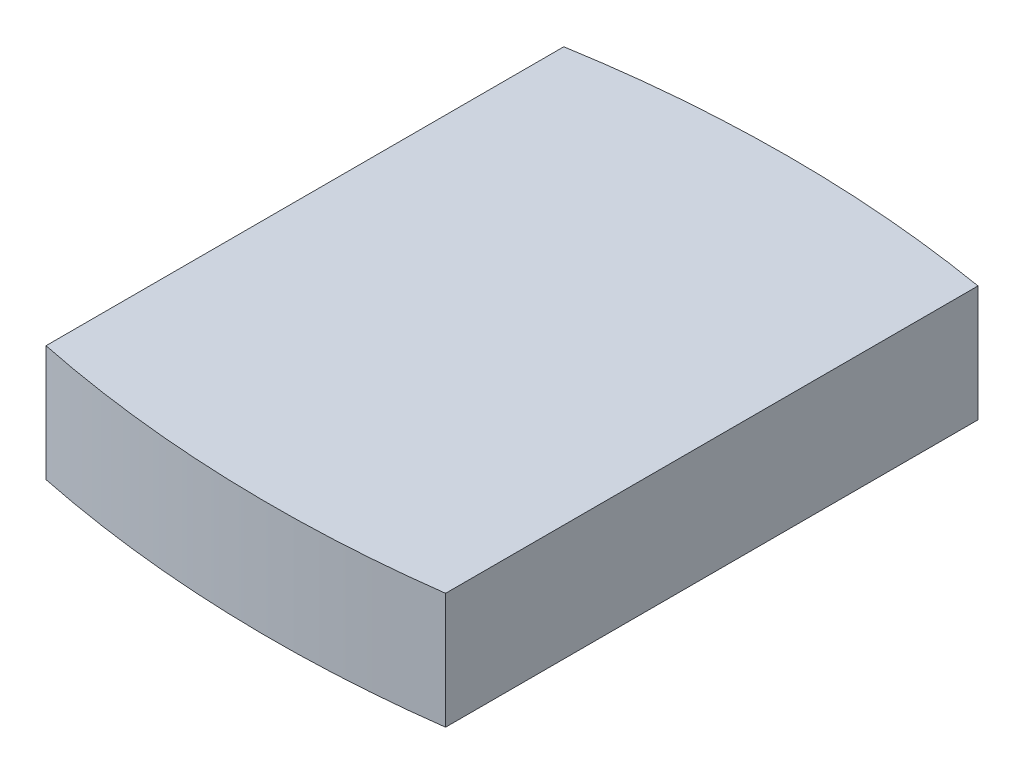
ISO-10303-21;
HEADER;
FILE_DESCRIPTION(('STEP AP214'),'2;1');
FILE_NAME('part.step','',(''),(''),'','','');
FILE_SCHEMA(('AUTOMOTIVE_DESIGN { 1 0 10303 214 1 1 1 1 }'));
ENDSEC;
DATA;
#1=APPLICATION_CONTEXT('core data for automotive mechanical design processes');
#2=APPLICATION_PROTOCOL_DEFINITION('international standard','automotive_design',2000,#1);
#3=PRODUCT_CONTEXT('',#1,'mechanical');
#4=PRODUCT('Part','Part','',(#3));
#5=PRODUCT_RELATED_PRODUCT_CATEGORY('part','',(#4));
#6=PRODUCT_DEFINITION_FORMATION('','',#4);
#7=PRODUCT_DEFINITION_CONTEXT('part definition',#1,'design');
#8=PRODUCT_DEFINITION('design','',#6,#7);
#9=PRODUCT_DEFINITION_SHAPE('','',#8);
#10=(LENGTH_UNIT() NAMED_UNIT(*) SI_UNIT(.MILLI.,.METRE.));
#11=(NAMED_UNIT(*) PLANE_ANGLE_UNIT() SI_UNIT($,.RADIAN.));
#12=(NAMED_UNIT(*) SI_UNIT($,.STERADIAN.) SOLID_ANGLE_UNIT());
#13=UNCERTAINTY_MEASURE_WITH_UNIT(LENGTH_MEASURE(1.E-05),#10,'distance_accuracy_value','');
#14=(GEOMETRIC_REPRESENTATION_CONTEXT(3) GLOBAL_UNCERTAINTY_ASSIGNED_CONTEXT((#13)) GLOBAL_UNIT_ASSIGNED_CONTEXT((#10,
#11,#12)) REPRESENTATION_CONTEXT('',''));
#15=CARTESIAN_POINT('',(0.,0.,0.));
#16=DIRECTION('',(0.,0.,1.));
#17=DIRECTION('',(1.,0.,0.));
#18=AXIS2_PLACEMENT_3D('',#15,#16,#17);
#19=CARTESIAN_POINT('',(12.0899913600632,5.6,-58.7693126462578));
#20=DIRECTION('',(0.,-1.,0.));
#21=DIRECTION('',(0.,0.,-1.));
#22=AXIS2_PLACEMENT_3D('',#19,#20,#21);
#23=CYLINDRICAL_SURFACE('',#22,60.);
#24=CARTESIAN_POINT('',(12.0899913600632,0.,-58.7693126462578));
#25=DIRECTION('',(0.,1.,0.));
#26=DIRECTION('',(0.,0.,1.));
#27=AXIS2_PLACEMENT_3D('',#24,#25,#26);
#28=CIRCLE('',#27,60.);
#29=CARTESIAN_POINT('',(0.,0.,0.));
#30=VERTEX_POINT('',#29);
#31=CARTESIAN_POINT('',(20.,0.,0.706999977476057));
#32=VERTEX_POINT('',#31);
#33=EDGE_CURVE('E98',#30,#32,#28,.T.);
#34=ORIENTED_EDGE('',*,*,#33,.T.);
#35=DIRECTION('',(0.,-1.,0.));
#36=VECTOR('',#35,1.);
#37=CARTESIAN_POINT('',(20.,5.6,0.706999977476057));
#38=LINE('',#37,#36);
#39=CARTESIAN_POINT('',(20.,5.6,0.706999977476057));
#40=VERTEX_POINT('',#39);
#41=EDGE_CURVE('E11',#40,#32,#38,.T.);
#42=ORIENTED_EDGE('',*,*,#41,.F.);
#43=CARTESIAN_POINT('',(12.0899913600632,5.6,-58.7693126462578));
#44=DIRECTION('',(0.,1.,0.));
#45=DIRECTION('',(0.,0.,1.));
#46=AXIS2_PLACEMENT_3D('',#43,#44,#45);
#47=CIRCLE('',#46,60.);
#48=CARTESIAN_POINT('',(0.,5.6,0.));
#49=VERTEX_POINT('',#48);
#50=EDGE_CURVE('E86',#49,#40,#47,.T.);
#51=ORIENTED_EDGE('',*,*,#50,.F.);
#52=DIRECTION('',(0.,-1.,0.));
#53=VECTOR('',#52,1.);
#54=CARTESIAN_POINT('',(0.,5.6,0.));
#55=LINE('',#54,#53);
#56=EDGE_CURVE('E94',#49,#30,#55,.T.);
#57=ORIENTED_EDGE('',*,*,#56,.T.);
#58=EDGE_LOOP('',(#34,#42,#51,#57));
#59=FACE_BOUND('',#58,.T.);
#60=ADVANCED_FACE('F35',(#59),#23,.T.);
#61=CARTESIAN_POINT('',(20.,5.6,-25.));
#62=DIRECTION('',(-1.,0.,0.));
#63=DIRECTION('',(0.,0.,1.));
#64=AXIS2_PLACEMENT_3D('',#61,#62,#63);
#65=PLANE('',#64);
#66=DIRECTION('',(0.,0.,-1.));
#67=VECTOR('',#66,1.);
#68=CARTESIAN_POINT('',(20.,0.,-25.));
#69=LINE('',#68,#67);
#70=CARTESIAN_POINT('',(20.,0.,-25.));
#71=VERTEX_POINT('',#70);
#72=EDGE_CURVE('E90',#32,#71,#69,.T.);
#73=ORIENTED_EDGE('',*,*,#72,.T.);
#74=DIRECTION('',(0.,-1.,0.));
#75=VECTOR('',#74,1.);
#76=CARTESIAN_POINT('',(20.,5.6,-25.));
#77=LINE('',#76,#75);
#78=CARTESIAN_POINT('',(20.,5.6,-25.));
#79=VERTEX_POINT('',#78);
#80=EDGE_CURVE('E43',#79,#71,#77,.T.);
#81=ORIENTED_EDGE('',*,*,#80,.F.);
#82=DIRECTION('',(0.,0.,-1.));
#83=VECTOR('',#82,1.);
#84=CARTESIAN_POINT('',(20.,5.6,-25.));
#85=LINE('',#84,#83);
#86=EDGE_CURVE('E81',#40,#79,#85,.T.);
#87=ORIENTED_EDGE('',*,*,#86,.F.);
#88=ORIENTED_EDGE('',*,*,#41,.T.);
#89=EDGE_LOOP('',(#73,#81,#87,#88));
#90=FACE_BOUND('',#89,.T.);
#91=ADVANCED_FACE('F89',(#90),#65,.F.);
#92=CARTESIAN_POINT('',(10.,5.6,34.1607978309962));
#93=DIRECTION('',(0.,-1.,0.));
#94=DIRECTION('',(0.,0.,-1.));
#95=AXIS2_PLACEMENT_3D('',#92,#93,#94);
#96=CYLINDRICAL_SURFACE('',#95,60.);
#97=CARTESIAN_POINT('',(10.,0.,34.1607978309962));
#98=DIRECTION('',(0.,1.,0.));
#99=DIRECTION('',(0.,0.,-1.));
#100=AXIS2_PLACEMENT_3D('',#97,#98,#99);
#101=CIRCLE('',#100,60.);
#102=CARTESIAN_POINT('',(0.,0.,-25.));
#103=VERTEX_POINT('',#102);
#104=EDGE_CURVE('E68',#71,#103,#101,.T.);
#105=ORIENTED_EDGE('',*,*,#104,.T.);
#106=DIRECTION('',(0.,-1.,0.));
#107=VECTOR('',#106,1.);
#108=CARTESIAN_POINT('',(0.,5.6,-25.));
#109=LINE('',#108,#107);
#110=CARTESIAN_POINT('',(0.,5.6,-25.));
#111=VERTEX_POINT('',#110);
#112=EDGE_CURVE('E91',#111,#103,#109,.T.);
#113=ORIENTED_EDGE('',*,*,#112,.F.);
#114=CARTESIAN_POINT('',(10.,5.6,34.1607978309962));
#115=DIRECTION('',(0.,1.,0.));
#116=DIRECTION('',(0.,0.,-1.));
#117=AXIS2_PLACEMENT_3D('',#114,#115,#116);
#118=CIRCLE('',#117,60.);
#119=EDGE_CURVE('E84',#79,#111,#118,.T.);
#120=ORIENTED_EDGE('',*,*,#119,.F.);
#121=ORIENTED_EDGE('',*,*,#80,.T.);
#122=EDGE_LOOP('',(#105,#113,#120,#121));
#123=FACE_BOUND('',#122,.T.);
#124=ADVANCED_FACE('F92',(#123),#96,.T.);
#125=CARTESIAN_POINT('',(0.,5.6,0.));
#126=DIRECTION('',(1.,0.,0.));
#127=DIRECTION('',(0.,0.,-1.));
#128=AXIS2_PLACEMENT_3D('',#125,#126,#127);
#129=PLANE('',#128);
#130=DIRECTION('',(0.,0.,1.));
#131=VECTOR('',#130,1.);
#132=CARTESIAN_POINT('',(0.,0.,0.));
#133=LINE('',#132,#131);
#134=EDGE_CURVE('E74',#103,#30,#133,.T.);
#135=ORIENTED_EDGE('',*,*,#134,.T.);
#136=ORIENTED_EDGE('',*,*,#56,.F.);
#137=DIRECTION('',(0.,0.,1.));
#138=VECTOR('',#137,1.);
#139=CARTESIAN_POINT('',(0.,5.6,0.));
#140=LINE('',#139,#138);
#141=EDGE_CURVE('E51',#111,#49,#140,.T.);
#142=ORIENTED_EDGE('',*,*,#141,.F.);
#143=ORIENTED_EDGE('',*,*,#112,.T.);
#144=EDGE_LOOP('',(#135,#136,#142,#143));
#145=FACE_BOUND('',#144,.T.);
#146=ADVANCED_FACE('F105',(#145),#129,.F.);
#147=CARTESIAN_POINT('',(12.0899913600632,5.6,-58.7693126462578));
#148=DIRECTION('',(0.,1.,0.));
#149=DIRECTION('',(0.,0.,1.));
#150=AXIS2_PLACEMENT_3D('',#147,#148,#149);
#151=PLANE('',#150);
#152=ORIENTED_EDGE('',*,*,#50,.T.);
#153=ORIENTED_EDGE('',*,*,#86,.T.);
#154=ORIENTED_EDGE('',*,*,#119,.T.);
#155=ORIENTED_EDGE('',*,*,#141,.T.);
#156=EDGE_LOOP('',(#152,#153,#154,#155));
#157=FACE_BOUND('',#156,.T.);
#158=ADVANCED_FACE('F82',(#157),#151,.T.);
#159=CARTESIAN_POINT('',(12.0899913600632,0.,-58.7693126462578));
#160=DIRECTION('',(0.,1.,0.));
#161=DIRECTION('',(0.,0.,1.));
#162=AXIS2_PLACEMENT_3D('',#159,#160,#161);
#163=PLANE('',#162);
#164=ORIENTED_EDGE('',*,*,#33,.F.);
#165=ORIENTED_EDGE('',*,*,#134,.F.);
#166=ORIENTED_EDGE('',*,*,#104,.F.);
#167=ORIENTED_EDGE('',*,*,#72,.F.);
#168=EDGE_LOOP('',(#164,#165,#166,#167));
#169=FACE_BOUND('',#168,.T.);
#170=ADVANCED_FACE('F108',(#169),#163,.F.);
#171=CLOSED_SHELL('',(#60,#91,#124,#146,#158,#170));
#172=MANIFOLD_SOLID_BREP('B2',#171);
#173=ADVANCED_BREP_SHAPE_REPRESENTATION('',(#18,#172),#14);
#174=SHAPE_DEFINITION_REPRESENTATION(#9,#173);
ENDSEC;
END-ISO-10303-21;
